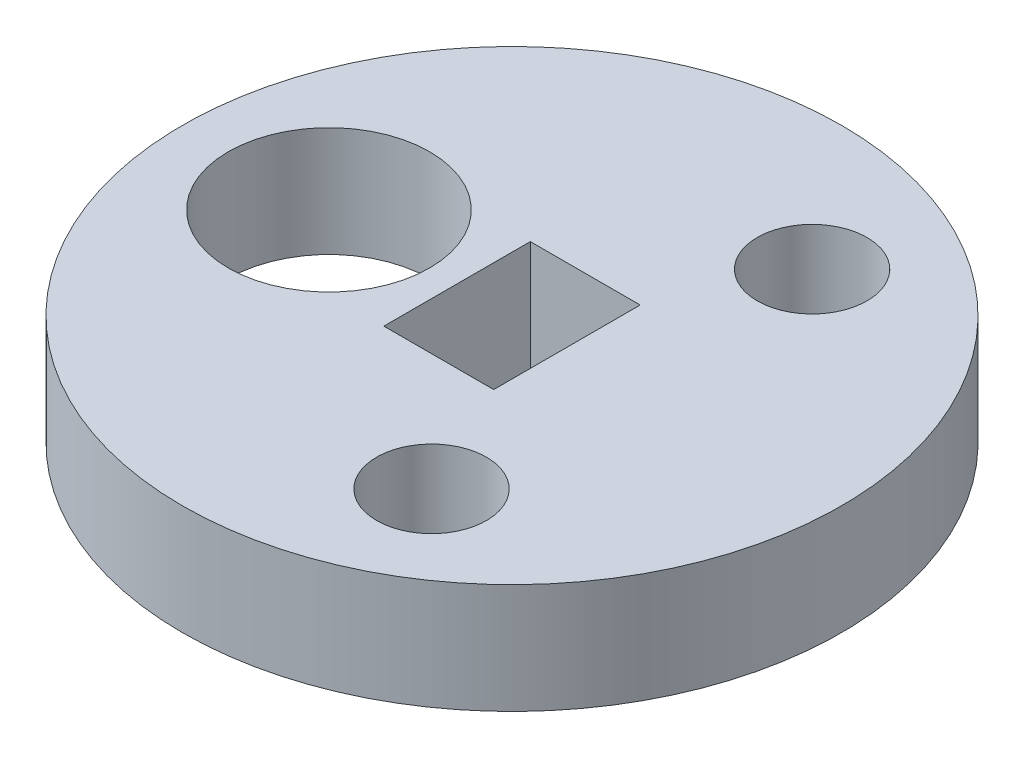
ISO-10303-21;
HEADER;
FILE_DESCRIPTION(('STEP AP214'),'2;1');
FILE_NAME('part.step','',(''),(''),'','','');
FILE_SCHEMA(('AUTOMOTIVE_DESIGN { 1 0 10303 214 1 1 1 1 }'));
ENDSEC;
DATA;
#1=APPLICATION_CONTEXT('core data for automotive mechanical design processes');
#2=APPLICATION_PROTOCOL_DEFINITION('international standard','automotive_design',2000,#1);
#3=PRODUCT_CONTEXT('',#1,'mechanical');
#4=PRODUCT('Part','Part','',(#3));
#5=PRODUCT_RELATED_PRODUCT_CATEGORY('part','',(#4));
#6=PRODUCT_DEFINITION_FORMATION('','',#4);
#7=PRODUCT_DEFINITION_CONTEXT('part definition',#1,'design');
#8=PRODUCT_DEFINITION('design','',#6,#7);
#9=PRODUCT_DEFINITION_SHAPE('','',#8);
#10=(LENGTH_UNIT() NAMED_UNIT(*) SI_UNIT(.MILLI.,.METRE.));
#11=(NAMED_UNIT(*) PLANE_ANGLE_UNIT() SI_UNIT($,.RADIAN.));
#12=(NAMED_UNIT(*) SI_UNIT($,.STERADIAN.) SOLID_ANGLE_UNIT());
#13=UNCERTAINTY_MEASURE_WITH_UNIT(LENGTH_MEASURE(1.E-05),#10,'distance_accuracy_value','');
#14=(GEOMETRIC_REPRESENTATION_CONTEXT(3) GLOBAL_UNCERTAINTY_ASSIGNED_CONTEXT((#13)) GLOBAL_UNIT_ASSIGNED_CONTEXT((#10,
#11,#12)) REPRESENTATION_CONTEXT('',''));
#15=CARTESIAN_POINT('',(0.,0.,0.));
#16=DIRECTION('',(0.,0.,1.));
#17=DIRECTION('',(1.,0.,0.));
#18=AXIS2_PLACEMENT_3D('',#15,#16,#17);
#19=CARTESIAN_POINT('',(0.,3.,0.));
#20=DIRECTION('',(0.,1.,0.));
#21=DIRECTION('',(0.,0.,1.));
#22=AXIS2_PLACEMENT_3D('',#19,#20,#21);
#23=PLANE('',#22);
#24=CARTESIAN_POINT('',(2.99913195908428,3.,5.19665348969885));
#25=DIRECTION('',(0.,1.,0.));
#26=DIRECTION('',(0.,0.,1.));
#27=AXIS2_PLACEMENT_3D('',#24,#25,#26);
#28=CIRCLE('',#27,1.5);
#29=CARTESIAN_POINT('',(2.99913195908428,3.,6.69665348969885));
#30=VERTEX_POINT('',#29);
#31=EDGE_CURVE('E205',#30,#30,#28,.T.);
#32=ORIENTED_EDGE('',*,*,#31,.F.);
#33=EDGE_LOOP('',(#32));
#34=FACE_BOUND('',#33,.T.);
#35=DIRECTION('',(0.,0.,1.));
#36=VECTOR('',#35,1.);
#37=CARTESIAN_POINT('',(-1.5,3.,-2.));
#38=LINE('',#37,#36);
#39=CARTESIAN_POINT('',(-1.5,3.,-2.));
#40=VERTEX_POINT('',#39);
#41=CARTESIAN_POINT('',(-1.5,3.,2.));
#42=VERTEX_POINT('',#41);
#43=EDGE_CURVE('E91',#40,#42,#38,.T.);
#44=ORIENTED_EDGE('',*,*,#43,.F.);
#45=DIRECTION('',(-1.,0.,0.));
#46=VECTOR('',#45,1.);
#47=CARTESIAN_POINT('',(-1.5,3.,-2.));
#48=LINE('',#47,#46);
#49=CARTESIAN_POINT('',(1.5,3.,-2.));
#50=VERTEX_POINT('',#49);
#51=EDGE_CURVE('E83',#50,#40,#48,.T.);
#52=ORIENTED_EDGE('',*,*,#51,.F.);
#53=DIRECTION('',(0.,0.,-1.));
#54=VECTOR('',#53,1.);
#55=CARTESIAN_POINT('',(1.5,3.,-2.));
#56=LINE('',#55,#54);
#57=CARTESIAN_POINT('',(1.5,3.,2.));
#58=VERTEX_POINT('',#57);
#59=EDGE_CURVE('E105',#58,#50,#56,.T.);
#60=ORIENTED_EDGE('',*,*,#59,.F.);
#61=DIRECTION('',(1.,0.,0.));
#62=VECTOR('',#61,1.);
#63=CARTESIAN_POINT('',(-1.5,3.,2.));
#64=LINE('',#63,#62);
#65=EDGE_CURVE('E103',#42,#58,#64,.T.);
#66=ORIENTED_EDGE('',*,*,#65,.F.);
#67=EDGE_LOOP('',(#44,#52,#60,#66));
#68=FACE_BOUND('',#67,.T.);
#69=CARTESIAN_POINT('',(0.,3.,0.));
#70=DIRECTION('',(0.,1.,0.));
#71=DIRECTION('',(0.,0.,1.));
#72=AXIS2_PLACEMENT_3D('',#69,#70,#71);
#73=CIRCLE('',#72,9.);
#74=CARTESIAN_POINT('',(0.,3.,9.));
#75=VERTEX_POINT('',#74);
#76=EDGE_CURVE('E11',#75,#75,#73,.T.);
#77=ORIENTED_EDGE('',*,*,#76,.T.);
#78=EDGE_LOOP('',(#77));
#79=FACE_BOUND('',#78,.T.);
#80=CARTESIAN_POINT('',(-5.,3.,-0.000835232483875));
#81=DIRECTION('',(0.,1.,0.));
#82=DIRECTION('',(0.,0.,1.));
#83=AXIS2_PLACEMENT_3D('',#80,#81,#82);
#84=CIRCLE('',#83,2.75);
#85=CARTESIAN_POINT('',(-5.,3.,2.74916476751612));
#86=VERTEX_POINT('',#85);
#87=EDGE_CURVE('E111',#86,#86,#84,.T.);
#88=ORIENTED_EDGE('',*,*,#87,.F.);
#89=EDGE_LOOP('',(#88));
#90=FACE_BOUND('',#89,.T.);
#91=CARTESIAN_POINT('',(3.00086795720212,3.,-5.19565121071821));
#92=DIRECTION('',(0.,1.,0.));
#93=DIRECTION('',(0.,0.,1.));
#94=AXIS2_PLACEMENT_3D('',#91,#92,#93);
#95=CIRCLE('',#94,1.5);
#96=CARTESIAN_POINT('',(3.00086795720212,3.,-3.6956512107182));
#97=VERTEX_POINT('',#96);
#98=EDGE_CURVE('E196',#97,#97,#95,.T.);
#99=ORIENTED_EDGE('',*,*,#98,.F.);
#100=EDGE_LOOP('',(#99));
#101=FACE_BOUND('',#100,.T.);
#102=ADVANCED_FACE('F42',(#34,#68,#79,#90,#101),#23,.T.);
#103=CARTESIAN_POINT('',(0.,0.,0.));
#104=DIRECTION('',(0.,1.,0.));
#105=DIRECTION('',(0.,0.,1.));
#106=AXIS2_PLACEMENT_3D('',#103,#104,#105);
#107=PLANE('',#106);
#108=CARTESIAN_POINT('',(0.,0.,0.));
#109=DIRECTION('',(0.,1.,0.));
#110=DIRECTION('',(0.,0.,1.));
#111=AXIS2_PLACEMENT_3D('',#108,#109,#110);
#112=CIRCLE('',#111,9.);
#113=CARTESIAN_POINT('',(0.,0.,9.));
#114=VERTEX_POINT('',#113);
#115=EDGE_CURVE('E46',#114,#114,#112,.T.);
#116=ORIENTED_EDGE('',*,*,#115,.F.);
#117=EDGE_LOOP('',(#116));
#118=FACE_BOUND('',#117,.T.);
#119=DIRECTION('',(-1.,0.,0.));
#120=VECTOR('',#119,1.);
#121=CARTESIAN_POINT('',(-1.5,0.,-2.));
#122=LINE('',#121,#120);
#123=CARTESIAN_POINT('',(1.5,0.,-2.));
#124=VERTEX_POINT('',#123);
#125=CARTESIAN_POINT('',(-1.5,0.,-2.));
#126=VERTEX_POINT('',#125);
#127=EDGE_CURVE('E65',#124,#126,#122,.T.);
#128=ORIENTED_EDGE('',*,*,#127,.T.);
#129=DIRECTION('',(0.,0.,1.));
#130=VECTOR('',#129,1.);
#131=CARTESIAN_POINT('',(-1.5,0.,-2.));
#132=LINE('',#131,#130);
#133=CARTESIAN_POINT('',(-1.5,0.,2.));
#134=VERTEX_POINT('',#133);
#135=EDGE_CURVE('E98',#126,#134,#132,.T.);
#136=ORIENTED_EDGE('',*,*,#135,.T.);
#137=DIRECTION('',(1.,0.,0.));
#138=VECTOR('',#137,1.);
#139=CARTESIAN_POINT('',(-1.5,0.,2.));
#140=LINE('',#139,#138);
#141=CARTESIAN_POINT('',(1.5,0.,2.));
#142=VERTEX_POINT('',#141);
#143=EDGE_CURVE('E113',#134,#142,#140,.T.);
#144=ORIENTED_EDGE('',*,*,#143,.T.);
#145=DIRECTION('',(0.,0.,-1.));
#146=VECTOR('',#145,1.);
#147=CARTESIAN_POINT('',(1.5,0.,-2.));
#148=LINE('',#147,#146);
#149=EDGE_CURVE('E92',#142,#124,#148,.T.);
#150=ORIENTED_EDGE('',*,*,#149,.T.);
#151=EDGE_LOOP('',(#128,#136,#144,#150));
#152=FACE_BOUND('',#151,.T.);
#153=CARTESIAN_POINT('',(-5.,0.,-0.000835232483875));
#154=DIRECTION('',(0.,1.,0.));
#155=DIRECTION('',(0.,0.,1.));
#156=AXIS2_PLACEMENT_3D('',#153,#154,#155);
#157=CIRCLE('',#156,2.75);
#158=CARTESIAN_POINT('',(-5.,0.,2.74916476751612));
#159=VERTEX_POINT('',#158);
#160=EDGE_CURVE('E208',#159,#159,#157,.T.);
#161=ORIENTED_EDGE('',*,*,#160,.T.);
#162=EDGE_LOOP('',(#161));
#163=FACE_BOUND('',#162,.T.);
#164=CARTESIAN_POINT('',(2.99913195908428,0.,5.19665348969885));
#165=DIRECTION('',(0.,1.,0.));
#166=DIRECTION('',(0.,0.,1.));
#167=AXIS2_PLACEMENT_3D('',#164,#165,#166);
#168=CIRCLE('',#167,1.5);
#169=CARTESIAN_POINT('',(2.99913195908428,0.,6.69665348969885));
#170=VERTEX_POINT('',#169);
#171=EDGE_CURVE('E202',#170,#170,#168,.T.);
#172=ORIENTED_EDGE('',*,*,#171,.T.);
#173=EDGE_LOOP('',(#172));
#174=FACE_BOUND('',#173,.T.);
#175=CARTESIAN_POINT('',(3.00086795720212,0.,-5.19565121071821));
#176=DIRECTION('',(0.,1.,0.));
#177=DIRECTION('',(0.,0.,1.));
#178=AXIS2_PLACEMENT_3D('',#175,#176,#177);
#179=CIRCLE('',#178,1.5);
#180=CARTESIAN_POINT('',(3.00086795720212,0.,-3.6956512107182));
#181=VERTEX_POINT('',#180);
#182=EDGE_CURVE('E199',#181,#181,#179,.T.);
#183=ORIENTED_EDGE('',*,*,#182,.T.);
#184=EDGE_LOOP('',(#183));
#185=FACE_BOUND('',#184,.T.);
#186=ADVANCED_FACE('F124',(#118,#152,#163,#174,#185),#107,.F.);
#187=CARTESIAN_POINT('',(0.,3.,0.));
#188=DIRECTION('',(0.,-1.,0.));
#189=DIRECTION('',(0.,0.,-1.));
#190=AXIS2_PLACEMENT_3D('',#187,#188,#189);
#191=CYLINDRICAL_SURFACE('',#190,9.);
#192=ORIENTED_EDGE('',*,*,#76,.F.);
#193=EDGE_LOOP('',(#192));
#194=FACE_BOUND('',#193,.T.);
#195=ORIENTED_EDGE('',*,*,#115,.T.);
#196=EDGE_LOOP('',(#195));
#197=FACE_BOUND('',#196,.T.);
#198=ADVANCED_FACE('F44',(#194,#197),#191,.T.);
#199=CARTESIAN_POINT('',(-1.5,3.,-2.));
#200=DIRECTION('',(0.,0.,1.));
#201=DIRECTION('',(1.,0.,0.));
#202=AXIS2_PLACEMENT_3D('',#199,#200,#201);
#203=PLANE('',#202);
#204=ORIENTED_EDGE('',*,*,#127,.F.);
#205=DIRECTION('',(0.,-1.,0.));
#206=VECTOR('',#205,1.);
#207=CARTESIAN_POINT('',(1.5,3.,-2.));
#208=LINE('',#207,#206);
#209=EDGE_CURVE('E87',#50,#124,#208,.T.);
#210=ORIENTED_EDGE('',*,*,#209,.F.);
#211=ORIENTED_EDGE('',*,*,#51,.T.);
#212=DIRECTION('',(0.,-1.,0.));
#213=VECTOR('',#212,1.);
#214=CARTESIAN_POINT('',(-1.5,3.,-2.));
#215=LINE('',#214,#213);
#216=EDGE_CURVE('E86',#40,#126,#215,.T.);
#217=ORIENTED_EDGE('',*,*,#216,.T.);
#218=EDGE_LOOP('',(#204,#210,#211,#217));
#219=FACE_BOUND('',#218,.T.);
#220=ADVANCED_FACE('F85',(#219),#203,.T.);
#221=CARTESIAN_POINT('',(-1.5,3.,-2.));
#222=DIRECTION('',(1.,0.,0.));
#223=DIRECTION('',(0.,0.,-1.));
#224=AXIS2_PLACEMENT_3D('',#221,#222,#223);
#225=PLANE('',#224);
#226=ORIENTED_EDGE('',*,*,#135,.F.);
#227=ORIENTED_EDGE('',*,*,#216,.F.);
#228=ORIENTED_EDGE('',*,*,#43,.T.);
#229=DIRECTION('',(0.,-1.,0.));
#230=VECTOR('',#229,1.);
#231=CARTESIAN_POINT('',(-1.5,3.,2.));
#232=LINE('',#231,#230);
#233=EDGE_CURVE('E99',#42,#134,#232,.T.);
#234=ORIENTED_EDGE('',*,*,#233,.T.);
#235=EDGE_LOOP('',(#226,#227,#228,#234));
#236=FACE_BOUND('',#235,.T.);
#237=ADVANCED_FACE('F95',(#236),#225,.T.);
#238=CARTESIAN_POINT('',(-1.5,3.,2.));
#239=DIRECTION('',(0.,0.,-1.));
#240=DIRECTION('',(-1.,0.,0.));
#241=AXIS2_PLACEMENT_3D('',#238,#239,#240);
#242=PLANE('',#241);
#243=ORIENTED_EDGE('',*,*,#143,.F.);
#244=ORIENTED_EDGE('',*,*,#233,.F.);
#245=ORIENTED_EDGE('',*,*,#65,.T.);
#246=DIRECTION('',(0.,-1.,0.));
#247=VECTOR('',#246,1.);
#248=CARTESIAN_POINT('',(1.5,3.,2.));
#249=LINE('',#248,#247);
#250=EDGE_CURVE('E57',#58,#142,#249,.T.);
#251=ORIENTED_EDGE('',*,*,#250,.T.);
#252=EDGE_LOOP('',(#243,#244,#245,#251));
#253=FACE_BOUND('',#252,.T.);
#254=ADVANCED_FACE('F122',(#253),#242,.T.);
#255=CARTESIAN_POINT('',(1.5,3.,-2.));
#256=DIRECTION('',(-1.,0.,0.));
#257=DIRECTION('',(0.,0.,1.));
#258=AXIS2_PLACEMENT_3D('',#255,#256,#257);
#259=PLANE('',#258);
#260=ORIENTED_EDGE('',*,*,#149,.F.);
#261=ORIENTED_EDGE('',*,*,#250,.F.);
#262=ORIENTED_EDGE('',*,*,#59,.T.);
#263=ORIENTED_EDGE('',*,*,#209,.T.);
#264=EDGE_LOOP('',(#260,#261,#262,#263));
#265=FACE_BOUND('',#264,.T.);
#266=ADVANCED_FACE('F126',(#265),#259,.T.);
#267=CARTESIAN_POINT('',(-5.,3.,-0.000835232483875));
#268=DIRECTION('',(0.,-1.,0.));
#269=DIRECTION('',(0.,0.,-1.));
#270=AXIS2_PLACEMENT_3D('',#267,#268,#269);
#271=CYLINDRICAL_SURFACE('',#270,2.75);
#272=ORIENTED_EDGE('',*,*,#87,.T.);
#273=EDGE_LOOP('',(#272));
#274=FACE_BOUND('',#273,.T.);
#275=ORIENTED_EDGE('',*,*,#160,.F.);
#276=EDGE_LOOP('',(#275));
#277=FACE_BOUND('',#276,.T.);
#278=ADVANCED_FACE('F128',(#274,#277),#271,.F.);
#279=CARTESIAN_POINT('',(2.99913195908428,3.,5.19665348969885));
#280=DIRECTION('',(0.,-1.,0.));
#281=DIRECTION('',(0.,0.,-1.));
#282=AXIS2_PLACEMENT_3D('',#279,#280,#281);
#283=CYLINDRICAL_SURFACE('',#282,1.5);
#284=ORIENTED_EDGE('',*,*,#31,.T.);
#285=EDGE_LOOP('',(#284));
#286=FACE_BOUND('',#285,.T.);
#287=ORIENTED_EDGE('',*,*,#171,.F.);
#288=EDGE_LOOP('',(#287));
#289=FACE_BOUND('',#288,.T.);
#290=ADVANCED_FACE('F134',(#286,#289),#283,.F.);
#291=CARTESIAN_POINT('',(3.00086795720212,3.,-5.19565121071821));
#292=DIRECTION('',(0.,-1.,0.));
#293=DIRECTION('',(0.,0.,-1.));
#294=AXIS2_PLACEMENT_3D('',#291,#292,#293);
#295=CYLINDRICAL_SURFACE('',#294,1.5);
#296=ORIENTED_EDGE('',*,*,#98,.T.);
#297=EDGE_LOOP('',(#296));
#298=FACE_BOUND('',#297,.T.);
#299=ORIENTED_EDGE('',*,*,#182,.F.);
#300=EDGE_LOOP('',(#299));
#301=FACE_BOUND('',#300,.T.);
#302=ADVANCED_FACE('F180',(#298,#301),#295,.F.);
#303=CLOSED_SHELL('',(#102,#186,#198,#220,#237,#254,#266,#278,#290,#302));
#304=MANIFOLD_SOLID_BREP('B2',#303);
#305=ADVANCED_BREP_SHAPE_REPRESENTATION('',(#18,#304),#14);
#306=SHAPE_DEFINITION_REPRESENTATION(#9,#305);
ENDSEC;
END-ISO-10303-21;
